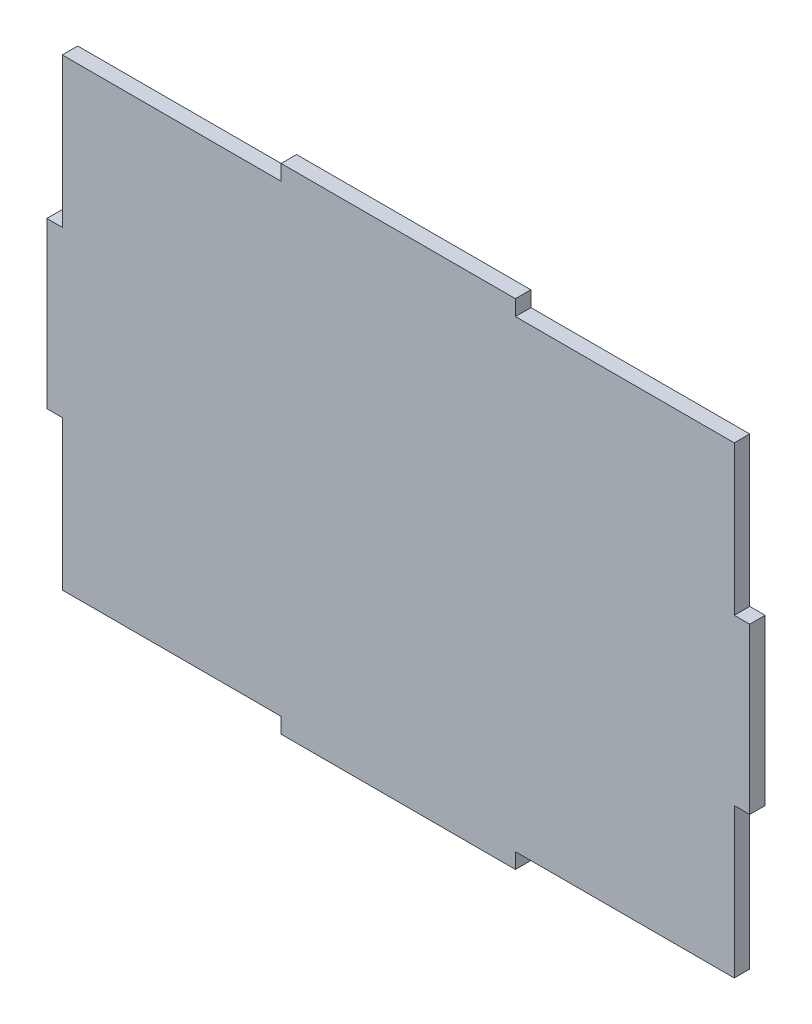
ISO-10303-21;
HEADER;
FILE_DESCRIPTION(('STEP AP214'),'2;1');
FILE_NAME('part.step','',(''),(''),'','','');
FILE_SCHEMA(('AUTOMOTIVE_DESIGN { 1 0 10303 214 1 1 1 1 }'));
ENDSEC;
DATA;
#1=APPLICATION_CONTEXT('core data for automotive mechanical design processes');
#2=APPLICATION_PROTOCOL_DEFINITION('international standard','automotive_design',2000,#1);
#3=PRODUCT_CONTEXT('',#1,'mechanical');
#4=PRODUCT('Part','Part','',(#3));
#5=PRODUCT_RELATED_PRODUCT_CATEGORY('part','',(#4));
#6=PRODUCT_DEFINITION_FORMATION('','',#4);
#7=PRODUCT_DEFINITION_CONTEXT('part definition',#1,'design');
#8=PRODUCT_DEFINITION('design','',#6,#7);
#9=PRODUCT_DEFINITION_SHAPE('','',#8);
#10=(LENGTH_UNIT() NAMED_UNIT(*) SI_UNIT(.MILLI.,.METRE.));
#11=(NAMED_UNIT(*) PLANE_ANGLE_UNIT() SI_UNIT($,.RADIAN.));
#12=(NAMED_UNIT(*) SI_UNIT($,.STERADIAN.) SOLID_ANGLE_UNIT());
#13=UNCERTAINTY_MEASURE_WITH_UNIT(LENGTH_MEASURE(1.E-05),#10,'distance_accuracy_value','');
#14=(GEOMETRIC_REPRESENTATION_CONTEXT(3) GLOBAL_UNCERTAINTY_ASSIGNED_CONTEXT((#13)) GLOBAL_UNIT_ASSIGNED_CONTEXT((#10,
#11,#12)) REPRESENTATION_CONTEXT('',''));
#15=CARTESIAN_POINT('',(0.,0.,0.));
#16=DIRECTION('',(0.,0.,1.));
#17=DIRECTION('',(1.,0.,0.));
#18=AXIS2_PLACEMENT_3D('',#15,#16,#17);
#19=CARTESIAN_POINT('',(115.57,-81.28,5.08));
#20=DIRECTION('',(-1.,0.,0.));
#21=DIRECTION('',(0.,0.,1.));
#22=AXIS2_PLACEMENT_3D('',#19,#20,#21);
#23=PLANE('',#22);
#24=DIRECTION('',(0.,0.,-1.));
#25=VECTOR('',#24,1.);
#26=CARTESIAN_POINT('',(115.57,-27.0933333333333,0.));
#27=LINE('',#26,#25);
#28=CARTESIAN_POINT('',(115.57,-27.0933333333333,5.07999999999998));
#29=VERTEX_POINT('',#28);
#30=CARTESIAN_POINT('',(115.57,-27.0933333333333,0.));
#31=VERTEX_POINT('',#30);
#32=EDGE_CURVE('E299',#29,#31,#27,.T.);
#33=ORIENTED_EDGE('',*,*,#32,.T.);
#34=DIRECTION('',(0.,1.,0.));
#35=VECTOR('',#34,1.);
#36=CARTESIAN_POINT('',(115.57,-81.28,0.));
#37=LINE('',#36,#35);
#38=CARTESIAN_POINT('',(115.57,27.0933333333333,0.));
#39=VERTEX_POINT('',#38);
#40=EDGE_CURVE('E199',#31,#39,#37,.T.);
#41=ORIENTED_EDGE('',*,*,#40,.T.);
#42=DIRECTION('',(0.,0.,1.));
#43=VECTOR('',#42,1.);
#44=CARTESIAN_POINT('',(115.57,27.0933333333333,0.));
#45=LINE('',#44,#43);
#46=CARTESIAN_POINT('',(115.57,27.0933333333333,5.07999999999998));
#47=VERTEX_POINT('',#46);
#48=EDGE_CURVE('E303',#39,#47,#45,.T.);
#49=ORIENTED_EDGE('',*,*,#48,.T.);
#50=DIRECTION('',(0.,1.,0.));
#51=VECTOR('',#50,1.);
#52=CARTESIAN_POINT('',(115.57,-81.28,5.08));
#53=LINE('',#52,#51);
#54=EDGE_CURVE('E209',#29,#47,#53,.T.);
#55=ORIENTED_EDGE('',*,*,#54,.F.);
#56=EDGE_LOOP('',(#33,#41,#49,#55));
#57=FACE_BOUND('',#56,.T.);
#58=ADVANCED_FACE('F33',(#57),#23,.F.);
#59=CARTESIAN_POINT('',(-115.57,81.28,5.08));
#60=DIRECTION('',(0.,-1.,0.));
#61=DIRECTION('',(0.,0.,-1.));
#62=AXIS2_PLACEMENT_3D('',#59,#60,#61);
#63=PLANE('',#62);
#64=DIRECTION('',(0.,0.,-1.));
#65=VECTOR('',#64,1.);
#66=CARTESIAN_POINT('',(-38.5233333333334,81.28,0.));
#67=LINE('',#66,#65);
#68=CARTESIAN_POINT('',(-38.5233333333334,81.28,5.07999999999997));
#69=VERTEX_POINT('',#68);
#70=CARTESIAN_POINT('',(-38.5233333333334,81.28,0.));
#71=VERTEX_POINT('',#70);
#72=EDGE_CURVE('E180',#69,#71,#67,.T.);
#73=ORIENTED_EDGE('',*,*,#72,.F.);
#74=DIRECTION('',(-1.,0.,0.));
#75=VECTOR('',#74,1.);
#76=CARTESIAN_POINT('',(-115.57,81.28,5.08));
#77=LINE('',#76,#75);
#78=CARTESIAN_POINT('',(38.5233333333333,81.28,5.07999999999997));
#79=VERTEX_POINT('',#78);
#80=EDGE_CURVE('E189',#79,#69,#77,.T.);
#81=ORIENTED_EDGE('',*,*,#80,.F.);
#82=DIRECTION('',(0.,0.,1.));
#83=VECTOR('',#82,1.);
#84=CARTESIAN_POINT('',(38.5233333333333,81.28,0.));
#85=LINE('',#84,#83);
#86=CARTESIAN_POINT('',(38.5233333333333,81.28,0.));
#87=VERTEX_POINT('',#86);
#88=EDGE_CURVE('E174',#87,#79,#85,.T.);
#89=ORIENTED_EDGE('',*,*,#88,.F.);
#90=DIRECTION('',(-1.,0.,0.));
#91=VECTOR('',#90,1.);
#92=CARTESIAN_POINT('',(-115.57,81.28,0.));
#93=LINE('',#92,#91);
#94=EDGE_CURVE('E187',#87,#71,#93,.T.);
#95=ORIENTED_EDGE('',*,*,#94,.T.);
#96=EDGE_LOOP('',(#73,#81,#89,#95));
#97=FACE_BOUND('',#96,.T.);
#98=ADVANCED_FACE('F186',(#97),#63,.F.);
#99=CARTESIAN_POINT('',(-115.57,-81.28,5.08));
#100=DIRECTION('',(1.,0.,0.));
#101=DIRECTION('',(0.,0.,-1.));
#102=AXIS2_PLACEMENT_3D('',#99,#100,#101);
#103=PLANE('',#102);
#104=DIRECTION('',(0.,0.,-1.));
#105=VECTOR('',#104,1.);
#106=CARTESIAN_POINT('',(-115.57,27.0933333333333,0.));
#107=LINE('',#106,#105);
#108=CARTESIAN_POINT('',(-115.57,27.0933333333333,5.07999999999998));
#109=VERTEX_POINT('',#108);
#110=CARTESIAN_POINT('',(-115.57,27.0933333333333,0.));
#111=VERTEX_POINT('',#110);
#112=EDGE_CURVE('E273',#109,#111,#107,.T.);
#113=ORIENTED_EDGE('',*,*,#112,.T.);
#114=DIRECTION('',(0.,-1.,0.));
#115=VECTOR('',#114,1.);
#116=CARTESIAN_POINT('',(-115.57,-81.28,0.));
#117=LINE('',#116,#115);
#118=CARTESIAN_POINT('',(-115.57,-27.0933333333334,0.));
#119=VERTEX_POINT('',#118);
#120=EDGE_CURVE('E198',#111,#119,#117,.T.);
#121=ORIENTED_EDGE('',*,*,#120,.T.);
#122=DIRECTION('',(0.,0.,1.));
#123=VECTOR('',#122,1.);
#124=CARTESIAN_POINT('',(-115.57,-27.0933333333334,0.));
#125=LINE('',#124,#123);
#126=CARTESIAN_POINT('',(-115.57,-27.0933333333334,5.07999999999998));
#127=VERTEX_POINT('',#126);
#128=EDGE_CURVE('E277',#119,#127,#125,.T.);
#129=ORIENTED_EDGE('',*,*,#128,.T.);
#130=DIRECTION('',(0.,-1.,0.));
#131=VECTOR('',#130,1.);
#132=CARTESIAN_POINT('',(-115.57,-81.28,5.08));
#133=LINE('',#132,#131);
#134=EDGE_CURVE('E41',#109,#127,#133,.T.);
#135=ORIENTED_EDGE('',*,*,#134,.F.);
#136=EDGE_LOOP('',(#113,#121,#129,#135));
#137=FACE_BOUND('',#136,.T.);
#138=ADVANCED_FACE('F374',(#137),#103,.F.);
#139=CARTESIAN_POINT('',(-115.57,-81.28,5.08));
#140=DIRECTION('',(0.,1.,0.));
#141=DIRECTION('',(0.,0.,1.));
#142=AXIS2_PLACEMENT_3D('',#139,#140,#141);
#143=PLANE('',#142);
#144=DIRECTION('',(0.,0.,-1.));
#145=VECTOR('',#144,1.);
#146=CARTESIAN_POINT('',(-38.5233333333334,-81.28,0.));
#147=LINE('',#146,#145);
#148=CARTESIAN_POINT('',(-38.5233333333334,-81.28,5.07999999999997));
#149=VERTEX_POINT('',#148);
#150=CARTESIAN_POINT('',(-38.5233333333334,-81.28,0.));
#151=VERTEX_POINT('',#150);
#152=EDGE_CURVE('E240',#149,#151,#147,.T.);
#153=ORIENTED_EDGE('',*,*,#152,.T.);
#154=DIRECTION('',(1.,0.,0.));
#155=VECTOR('',#154,1.);
#156=CARTESIAN_POINT('',(-115.57,-81.28,0.));
#157=LINE('',#156,#155);
#158=CARTESIAN_POINT('',(38.5233333333333,-81.28,0.));
#159=VERTEX_POINT('',#158);
#160=EDGE_CURVE('E36',#151,#159,#157,.T.);
#161=ORIENTED_EDGE('',*,*,#160,.T.);
#162=DIRECTION('',(0.,0.,1.));
#163=VECTOR('',#162,1.);
#164=CARTESIAN_POINT('',(38.5233333333333,-81.28,0.));
#165=LINE('',#164,#163);
#166=CARTESIAN_POINT('',(38.5233333333333,-81.28,5.07999999999997));
#167=VERTEX_POINT('',#166);
#168=EDGE_CURVE('E244',#159,#167,#165,.T.);
#169=ORIENTED_EDGE('',*,*,#168,.T.);
#170=DIRECTION('',(1.,0.,0.));
#171=VECTOR('',#170,1.);
#172=CARTESIAN_POINT('',(-115.57,-81.28,5.08));
#173=LINE('',#172,#171);
#174=EDGE_CURVE('E11',#149,#167,#173,.T.);
#175=ORIENTED_EDGE('',*,*,#174,.F.);
#176=EDGE_LOOP('',(#153,#161,#169,#175));
#177=FACE_BOUND('',#176,.T.);
#178=ADVANCED_FACE('F355',(#177),#143,.F.);
#179=CARTESIAN_POINT('',(0.,0.,5.08));
#180=DIRECTION('',(0.,0.,-1.));
#181=DIRECTION('',(-1.,0.,0.));
#182=AXIS2_PLACEMENT_3D('',#179,#180,#181);
#183=PLANE('',#182);
#184=DIRECTION('',(0.,-1.,0.));
#185=VECTOR('',#184,1.);
#186=CARTESIAN_POINT('',(-38.5233333333334,81.28,5.07999999999997));
#187=LINE('',#186,#185);
#188=CARTESIAN_POINT('',(-38.5233333333334,76.2,5.07999999999997));
#189=VERTEX_POINT('',#188);
#190=EDGE_CURVE('E312',#69,#189,#187,.T.);
#191=ORIENTED_EDGE('',*,*,#190,.T.);
#192=DIRECTION('',(1.,0.,0.));
#193=VECTOR('',#192,1.);
#194=CARTESIAN_POINT('',(0.,76.2,5.08));
#195=LINE('',#194,#193);
#196=CARTESIAN_POINT('',(-110.49,76.2,5.08));
#197=VERTEX_POINT('',#196);
#198=EDGE_CURVE('E223',#197,#189,#195,.T.);
#199=ORIENTED_EDGE('',*,*,#198,.F.);
#200=DIRECTION('',(0.,-1.,0.));
#201=VECTOR('',#200,1.);
#202=CARTESIAN_POINT('',(-110.49,0.,5.08));
#203=LINE('',#202,#201);
#204=CARTESIAN_POINT('',(-110.49,27.0933333333333,5.07999999999998));
#205=VERTEX_POINT('',#204);
#206=EDGE_CURVE('E215',#197,#205,#203,.T.);
#207=ORIENTED_EDGE('',*,*,#206,.T.);
#208=DIRECTION('',(-1.,0.,0.));
#209=VECTOR('',#208,1.);
#210=CARTESIAN_POINT('',(-110.49,27.0933333333333,5.07999999999998));
#211=LINE('',#210,#209);
#212=EDGE_CURVE('E268',#205,#109,#211,.T.);
#213=ORIENTED_EDGE('',*,*,#212,.T.);
#214=ORIENTED_EDGE('',*,*,#134,.T.);
#215=DIRECTION('',(-1.,0.,0.));
#216=VECTOR('',#215,1.);
#217=CARTESIAN_POINT('',(-110.49,-27.0933333333334,5.07999999999998));
#218=LINE('',#217,#216);
#219=CARTESIAN_POINT('',(-110.49,-27.0933333333334,5.07999999999998));
#220=VERTEX_POINT('',#219);
#221=EDGE_CURVE('E265',#220,#127,#218,.T.);
#222=ORIENTED_EDGE('',*,*,#221,.F.);
#223=CARTESIAN_POINT('',(-110.49,-76.2,5.08000000000002));
#224=VERTEX_POINT('',#223);
#225=EDGE_CURVE('E216',#220,#224,#203,.T.);
#226=ORIENTED_EDGE('',*,*,#225,.T.);
#227=DIRECTION('',(1.,0.,0.));
#228=VECTOR('',#227,1.);
#229=CARTESIAN_POINT('',(0.,-76.2,5.08));
#230=LINE('',#229,#228);
#231=CARTESIAN_POINT('',(-38.5233333333334,-76.2,5.07999999999997));
#232=VERTEX_POINT('',#231);
#233=EDGE_CURVE('E203',#224,#232,#230,.T.);
#234=ORIENTED_EDGE('',*,*,#233,.T.);
#235=DIRECTION('',(0.,-1.,0.));
#236=VECTOR('',#235,1.);
#237=CARTESIAN_POINT('',(-38.5233333333334,-76.2,5.07999999999997));
#238=LINE('',#237,#236);
#239=EDGE_CURVE('E235',#232,#149,#238,.T.);
#240=ORIENTED_EDGE('',*,*,#239,.T.);
#241=ORIENTED_EDGE('',*,*,#174,.T.);
#242=DIRECTION('',(0.,-1.,0.));
#243=VECTOR('',#242,1.);
#244=CARTESIAN_POINT('',(38.5233333333333,-76.2,5.07999999999997));
#245=LINE('',#244,#243);
#246=CARTESIAN_POINT('',(38.5233333333333,-76.2,5.07999999999997));
#247=VERTEX_POINT('',#246);
#248=EDGE_CURVE('E232',#247,#167,#245,.T.);
#249=ORIENTED_EDGE('',*,*,#248,.F.);
#250=CARTESIAN_POINT('',(110.49,-76.2,5.08000000000002));
#251=VERTEX_POINT('',#250);
#252=EDGE_CURVE('E212',#247,#251,#230,.T.);
#253=ORIENTED_EDGE('',*,*,#252,.T.);
#254=DIRECTION('',(0.,1.,0.));
#255=VECTOR('',#254,1.);
#256=CARTESIAN_POINT('',(110.49,0.,5.08));
#257=LINE('',#256,#255);
#258=CARTESIAN_POINT('',(110.49,-27.0933333333333,5.07999999999998));
#259=VERTEX_POINT('',#258);
#260=EDGE_CURVE('E219',#251,#259,#257,.T.);
#261=ORIENTED_EDGE('',*,*,#260,.T.);
#262=DIRECTION('',(1.,0.,0.));
#263=VECTOR('',#262,1.);
#264=CARTESIAN_POINT('',(110.49,-27.0933333333333,5.07999999999998));
#265=LINE('',#264,#263);
#266=EDGE_CURVE('E294',#259,#29,#265,.T.);
#267=ORIENTED_EDGE('',*,*,#266,.T.);
#268=ORIENTED_EDGE('',*,*,#54,.T.);
#269=DIRECTION('',(1.,0.,0.));
#270=VECTOR('',#269,1.);
#271=CARTESIAN_POINT('',(110.49,27.0933333333333,5.07999999999998));
#272=LINE('',#271,#270);
#273=CARTESIAN_POINT('',(110.49,27.0933333333333,5.07999999999998));
#274=VERTEX_POINT('',#273);
#275=EDGE_CURVE('E292',#274,#47,#272,.T.);
#276=ORIENTED_EDGE('',*,*,#275,.F.);
#277=CARTESIAN_POINT('',(110.49,76.2,5.08));
#278=VERTEX_POINT('',#277);
#279=EDGE_CURVE('E220',#274,#278,#257,.T.);
#280=ORIENTED_EDGE('',*,*,#279,.T.);
#281=CARTESIAN_POINT('',(38.5233333333333,76.2,5.07999999999997));
#282=VERTEX_POINT('',#281);
#283=EDGE_CURVE('E224',#282,#278,#195,.T.);
#284=ORIENTED_EDGE('',*,*,#283,.F.);
#285=DIRECTION('',(0.,-1.,0.));
#286=VECTOR('',#285,1.);
#287=CARTESIAN_POINT('',(38.5233333333333,81.28,5.07999999999997));
#288=LINE('',#287,#286);
#289=EDGE_CURVE('E179',#79,#282,#288,.T.);
#290=ORIENTED_EDGE('',*,*,#289,.F.);
#291=ORIENTED_EDGE('',*,*,#80,.T.);
#292=EDGE_LOOP('',(#191,#199,#207,#213,#214,#222,#226,#234,#240,#241,#249,#253,#261,#267,#268,
#276,#280,#284,#290,#291));
#293=FACE_BOUND('',#292,.T.);
#294=ADVANCED_FACE('F322',(#293),#183,.F.);
#295=CARTESIAN_POINT('',(0.,0.,0.));
#296=DIRECTION('',(0.,0.,-1.));
#297=DIRECTION('',(-1.,0.,0.));
#298=AXIS2_PLACEMENT_3D('',#295,#296,#297);
#299=PLANE('',#298);
#300=ORIENTED_EDGE('',*,*,#160,.F.);
#301=DIRECTION('',(0.,-1.,0.));
#302=VECTOR('',#301,1.);
#303=CARTESIAN_POINT('',(-38.5233333333334,-76.2,0.));
#304=LINE('',#303,#302);
#305=CARTESIAN_POINT('',(-38.5233333333334,-76.2,0.));
#306=VERTEX_POINT('',#305);
#307=EDGE_CURVE('E238',#306,#151,#304,.T.);
#308=ORIENTED_EDGE('',*,*,#307,.F.);
#309=DIRECTION('',(1.,0.,0.));
#310=VECTOR('',#309,1.);
#311=CARTESIAN_POINT('',(-115.57,-76.2,0.));
#312=LINE('',#311,#310);
#313=CARTESIAN_POINT('',(-110.49,-76.2,0.));
#314=VERTEX_POINT('',#313);
#315=EDGE_CURVE('E226',#314,#306,#312,.T.);
#316=ORIENTED_EDGE('',*,*,#315,.F.);
#317=DIRECTION('',(0.,-1.,0.));
#318=VECTOR('',#317,1.);
#319=CARTESIAN_POINT('',(-110.49,81.28,0.));
#320=LINE('',#319,#318);
#321=CARTESIAN_POINT('',(-110.49,-27.0933333333334,0.));
#322=VERTEX_POINT('',#321);
#323=EDGE_CURVE('E261',#322,#314,#320,.T.);
#324=ORIENTED_EDGE('',*,*,#323,.F.);
#325=DIRECTION('',(-1.,0.,0.));
#326=VECTOR('',#325,1.);
#327=CARTESIAN_POINT('',(-110.49,-27.0933333333334,0.));
#328=LINE('',#327,#326);
#329=EDGE_CURVE('E262',#322,#119,#328,.T.);
#330=ORIENTED_EDGE('',*,*,#329,.T.);
#331=ORIENTED_EDGE('',*,*,#120,.F.);
#332=DIRECTION('',(-1.,0.,0.));
#333=VECTOR('',#332,1.);
#334=CARTESIAN_POINT('',(-110.49,27.0933333333333,0.));
#335=LINE('',#334,#333);
#336=CARTESIAN_POINT('',(-110.49,27.0933333333333,0.));
#337=VERTEX_POINT('',#336);
#338=EDGE_CURVE('E271',#337,#111,#335,.T.);
#339=ORIENTED_EDGE('',*,*,#338,.F.);
#340=CARTESIAN_POINT('',(-110.49,76.2,0.));
#341=VERTEX_POINT('',#340);
#342=EDGE_CURVE('E259',#341,#337,#320,.T.);
#343=ORIENTED_EDGE('',*,*,#342,.F.);
#344=DIRECTION('',(1.,0.,0.));
#345=VECTOR('',#344,1.);
#346=CARTESIAN_POINT('',(-115.57,76.2,0.));
#347=LINE('',#346,#345);
#348=CARTESIAN_POINT('',(-38.5233333333334,76.2,0.));
#349=VERTEX_POINT('',#348);
#350=EDGE_CURVE('E306',#341,#349,#347,.T.);
#351=ORIENTED_EDGE('',*,*,#350,.T.);
#352=DIRECTION('',(0.,-1.,0.));
#353=VECTOR('',#352,1.);
#354=CARTESIAN_POINT('',(-38.5233333333334,81.28,0.));
#355=LINE('',#354,#353);
#356=EDGE_CURVE('E197',#71,#349,#355,.T.);
#357=ORIENTED_EDGE('',*,*,#356,.F.);
#358=ORIENTED_EDGE('',*,*,#94,.F.);
#359=DIRECTION('',(0.,-1.,0.));
#360=VECTOR('',#359,1.);
#361=CARTESIAN_POINT('',(38.5233333333333,81.28,0.));
#362=LINE('',#361,#360);
#363=CARTESIAN_POINT('',(38.5233333333333,76.2,0.));
#364=VERTEX_POINT('',#363);
#365=EDGE_CURVE('E171',#87,#364,#362,.T.);
#366=ORIENTED_EDGE('',*,*,#365,.T.);
#367=CARTESIAN_POINT('',(110.49,76.2,0.));
#368=VERTEX_POINT('',#367);
#369=EDGE_CURVE('E57',#364,#368,#347,.T.);
#370=ORIENTED_EDGE('',*,*,#369,.T.);
#371=DIRECTION('',(0.,1.,0.));
#372=VECTOR('',#371,1.);
#373=CARTESIAN_POINT('',(110.49,-81.28,0.));
#374=LINE('',#373,#372);
#375=CARTESIAN_POINT('',(110.49,27.0933333333333,0.));
#376=VERTEX_POINT('',#375);
#377=EDGE_CURVE('E288',#376,#368,#374,.T.);
#378=ORIENTED_EDGE('',*,*,#377,.F.);
#379=DIRECTION('',(1.,0.,0.));
#380=VECTOR('',#379,1.);
#381=CARTESIAN_POINT('',(110.49,27.0933333333333,0.));
#382=LINE('',#381,#380);
#383=EDGE_CURVE('E289',#376,#39,#382,.T.);
#384=ORIENTED_EDGE('',*,*,#383,.T.);
#385=ORIENTED_EDGE('',*,*,#40,.F.);
#386=DIRECTION('',(1.,0.,0.));
#387=VECTOR('',#386,1.);
#388=CARTESIAN_POINT('',(110.49,-27.0933333333333,0.));
#389=LINE('',#388,#387);
#390=CARTESIAN_POINT('',(110.49,-27.0933333333333,0.));
#391=VERTEX_POINT('',#390);
#392=EDGE_CURVE('E297',#391,#31,#389,.T.);
#393=ORIENTED_EDGE('',*,*,#392,.F.);
#394=CARTESIAN_POINT('',(110.49,-76.2,0.));
#395=VERTEX_POINT('',#394);
#396=EDGE_CURVE('E286',#395,#391,#374,.T.);
#397=ORIENTED_EDGE('',*,*,#396,.F.);
#398=CARTESIAN_POINT('',(38.5233333333333,-76.2,0.));
#399=VERTEX_POINT('',#398);
#400=EDGE_CURVE('E228',#399,#395,#312,.T.);
#401=ORIENTED_EDGE('',*,*,#400,.F.);
#402=DIRECTION('',(0.,-1.,0.));
#403=VECTOR('',#402,1.);
#404=CARTESIAN_POINT('',(38.5233333333333,-76.2,0.));
#405=LINE('',#404,#403);
#406=EDGE_CURVE('E229',#399,#159,#405,.T.);
#407=ORIENTED_EDGE('',*,*,#406,.T.);
#408=EDGE_LOOP('',(#300,#308,#316,#324,#330,#331,#339,#343,#351,#357,#358,#366,#370,#378,#384,
#385,#393,#397,#401,#407));
#409=FACE_BOUND('',#408,.T.);
#410=ADVANCED_FACE('F194',(#409),#299,.T.);
#411=CARTESIAN_POINT('',(38.5233333333333,81.28,0.));
#412=DIRECTION('',(1.,0.,0.));
#413=DIRECTION('',(0.,1.,0.));
#414=AXIS2_PLACEMENT_3D('',#411,#412,#413);
#415=PLANE('',#414);
#416=DIRECTION('',(0.,0.,1.));
#417=VECTOR('',#416,1.);
#418=CARTESIAN_POINT('',(38.5233333333333,76.2,0.));
#419=LINE('',#418,#417);
#420=EDGE_CURVE('E176',#364,#282,#419,.T.);
#421=ORIENTED_EDGE('',*,*,#420,.F.);
#422=ORIENTED_EDGE('',*,*,#365,.F.);
#423=ORIENTED_EDGE('',*,*,#88,.T.);
#424=ORIENTED_EDGE('',*,*,#289,.T.);
#425=EDGE_LOOP('',(#421,#422,#423,#424));
#426=FACE_BOUND('',#425,.T.);
#427=ADVANCED_FACE('F173',(#426),#415,.T.);
#428=CARTESIAN_POINT('',(0.,76.2,36.83));
#429=DIRECTION('',(0.,1.,0.));
#430=DIRECTION('',(-1.,0.,0.));
#431=AXIS2_PLACEMENT_3D('',#428,#429,#430);
#432=PLANE('',#431);
#433=ORIENTED_EDGE('',*,*,#283,.T.);
#434=DIRECTION('',(0.,0.,-1.));
#435=VECTOR('',#434,1.);
#436=CARTESIAN_POINT('',(110.49,76.2,36.83));
#437=LINE('',#436,#435);
#438=EDGE_CURVE('E280',#278,#368,#437,.T.);
#439=ORIENTED_EDGE('',*,*,#438,.T.);
#440=ORIENTED_EDGE('',*,*,#369,.F.);
#441=ORIENTED_EDGE('',*,*,#420,.T.);
#442=EDGE_LOOP('',(#433,#439,#440,#441));
#443=FACE_BOUND('',#442,.T.);
#444=ADVANCED_FACE('F325',(#443),#432,.T.);
#445=CARTESIAN_POINT('',(110.49,27.0933333333333,0.));
#446=DIRECTION('',(0.,1.,0.));
#447=DIRECTION('',(-1.,0.,0.));
#448=AXIS2_PLACEMENT_3D('',#445,#446,#447);
#449=PLANE('',#448);
#450=ORIENTED_EDGE('',*,*,#48,.F.);
#451=ORIENTED_EDGE('',*,*,#383,.F.);
#452=DIRECTION('',(0.,0.,1.));
#453=VECTOR('',#452,1.);
#454=CARTESIAN_POINT('',(110.49,27.0933333333333,0.));
#455=LINE('',#454,#453);
#456=EDGE_CURVE('E302',#376,#274,#455,.T.);
#457=ORIENTED_EDGE('',*,*,#456,.T.);
#458=ORIENTED_EDGE('',*,*,#275,.T.);
#459=EDGE_LOOP('',(#450,#451,#457,#458));
#460=FACE_BOUND('',#459,.T.);
#461=ADVANCED_FACE('F334',(#460),#449,.T.);
#462=CARTESIAN_POINT('',(110.49,0.,36.83));
#463=DIRECTION('',(-1.,0.,0.));
#464=DIRECTION('',(0.,-1.,0.));
#465=AXIS2_PLACEMENT_3D('',#462,#463,#464);
#466=PLANE('',#465);
#467=ORIENTED_EDGE('',*,*,#456,.F.);
#468=ORIENTED_EDGE('',*,*,#377,.T.);
#469=ORIENTED_EDGE('',*,*,#438,.F.);
#470=ORIENTED_EDGE('',*,*,#279,.F.);
#471=EDGE_LOOP('',(#467,#468,#469,#470));
#472=FACE_BOUND('',#471,.T.);
#473=ADVANCED_FACE('F329',(#472),#466,.F.);
#474=CARTESIAN_POINT('',(-110.49,27.0933333333333,0.));
#475=DIRECTION('',(0.,1.,0.));
#476=DIRECTION('',(-1.,0.,0.));
#477=AXIS2_PLACEMENT_3D('',#474,#475,#476);
#478=PLANE('',#477);
#479=ORIENTED_EDGE('',*,*,#112,.F.);
#480=ORIENTED_EDGE('',*,*,#212,.F.);
#481=DIRECTION('',(0.,0.,-1.));
#482=VECTOR('',#481,1.);
#483=CARTESIAN_POINT('',(-110.49,27.0933333333333,0.));
#484=LINE('',#483,#482);
#485=EDGE_CURVE('E266',#205,#337,#484,.T.);
#486=ORIENTED_EDGE('',*,*,#485,.T.);
#487=ORIENTED_EDGE('',*,*,#338,.T.);
#488=EDGE_LOOP('',(#479,#480,#486,#487));
#489=FACE_BOUND('',#488,.T.);
#490=ADVANCED_FACE('F377',(#489),#478,.T.);
#491=CARTESIAN_POINT('',(-38.5233333333334,81.28,0.));
#492=DIRECTION('',(-1.,0.,0.));
#493=DIRECTION('',(0.,-1.,0.));
#494=AXIS2_PLACEMENT_3D('',#491,#492,#493);
#495=PLANE('',#494);
#496=DIRECTION('',(0.,0.,-1.));
#497=VECTOR('',#496,1.);
#498=CARTESIAN_POINT('',(-38.5233333333334,76.2,0.));
#499=LINE('',#498,#497);
#500=EDGE_CURVE('E190',#189,#349,#499,.T.);
#501=ORIENTED_EDGE('',*,*,#500,.F.);
#502=ORIENTED_EDGE('',*,*,#190,.F.);
#503=ORIENTED_EDGE('',*,*,#72,.T.);
#504=ORIENTED_EDGE('',*,*,#356,.T.);
#505=EDGE_LOOP('',(#501,#502,#503,#504));
#506=FACE_BOUND('',#505,.T.);
#507=ADVANCED_FACE('F320',(#506),#495,.T.);
#508=ORIENTED_EDGE('',*,*,#198,.T.);
#509=ORIENTED_EDGE('',*,*,#500,.T.);
#510=ORIENTED_EDGE('',*,*,#350,.F.);
#511=DIRECTION('',(0.,0.,1.));
#512=VECTOR('',#511,1.);
#513=CARTESIAN_POINT('',(-110.49,76.2,36.83));
#514=LINE('',#513,#512);
#515=EDGE_CURVE('E256',#341,#197,#514,.T.);
#516=ORIENTED_EDGE('',*,*,#515,.T.);
#517=EDGE_LOOP('',(#508,#509,#510,#516));
#518=FACE_BOUND('',#517,.T.);
#519=ADVANCED_FACE('F384',(#518),#432,.T.);
#520=CARTESIAN_POINT('',(-110.49,0.,36.83));
#521=DIRECTION('',(1.,0.,0.));
#522=DIRECTION('',(0.,1.,0.));
#523=AXIS2_PLACEMENT_3D('',#520,#521,#522);
#524=PLANE('',#523);
#525=ORIENTED_EDGE('',*,*,#515,.F.);
#526=ORIENTED_EDGE('',*,*,#342,.T.);
#527=ORIENTED_EDGE('',*,*,#485,.F.);
#528=ORIENTED_EDGE('',*,*,#206,.F.);
#529=EDGE_LOOP('',(#525,#526,#527,#528));
#530=FACE_BOUND('',#529,.T.);
#531=ADVANCED_FACE('F381',(#530),#524,.F.);
#532=CARTESIAN_POINT('',(110.49,-27.0933333333333,0.));
#533=DIRECTION('',(0.,-1.,0.));
#534=DIRECTION('',(1.,0.,0.));
#535=AXIS2_PLACEMENT_3D('',#532,#533,#534);
#536=PLANE('',#535);
#537=ORIENTED_EDGE('',*,*,#32,.F.);
#538=ORIENTED_EDGE('',*,*,#266,.F.);
#539=DIRECTION('',(0.,0.,-1.));
#540=VECTOR('',#539,1.);
#541=CARTESIAN_POINT('',(110.49,-27.0933333333333,0.));
#542=LINE('',#541,#540);
#543=EDGE_CURVE('E49',#259,#391,#542,.T.);
#544=ORIENTED_EDGE('',*,*,#543,.T.);
#545=ORIENTED_EDGE('',*,*,#392,.T.);
#546=EDGE_LOOP('',(#537,#538,#544,#545));
#547=FACE_BOUND('',#546,.T.);
#548=ADVANCED_FACE('F341',(#547),#536,.T.);
#549=DIRECTION('',(0.,0.,-1.));
#550=VECTOR('',#549,1.);
#551=CARTESIAN_POINT('',(110.49,-76.2,49.1066666666666));
#552=LINE('',#551,#550);
#553=EDGE_CURVE('E254',#251,#395,#552,.T.);
#554=ORIENTED_EDGE('',*,*,#553,.T.);
#555=ORIENTED_EDGE('',*,*,#396,.T.);
#556=ORIENTED_EDGE('',*,*,#543,.F.);
#557=ORIENTED_EDGE('',*,*,#260,.F.);
#558=EDGE_LOOP('',(#554,#555,#556,#557));
#559=FACE_BOUND('',#558,.T.);
#560=ADVANCED_FACE('F346',(#559),#466,.F.);
#561=CARTESIAN_POINT('',(38.5233333333333,-76.2,0.));
#562=DIRECTION('',(1.,0.,0.));
#563=DIRECTION('',(0.,1.,0.));
#564=AXIS2_PLACEMENT_3D('',#561,#562,#563);
#565=PLANE('',#564);
#566=ORIENTED_EDGE('',*,*,#168,.F.);
#567=ORIENTED_EDGE('',*,*,#406,.F.);
#568=DIRECTION('',(0.,0.,1.));
#569=VECTOR('',#568,1.);
#570=CARTESIAN_POINT('',(38.5233333333333,-76.2,0.));
#571=LINE('',#570,#569);
#572=EDGE_CURVE('E243',#399,#247,#571,.T.);
#573=ORIENTED_EDGE('',*,*,#572,.T.);
#574=ORIENTED_EDGE('',*,*,#248,.T.);
#575=EDGE_LOOP('',(#566,#567,#573,#574));
#576=FACE_BOUND('',#575,.T.);
#577=ADVANCED_FACE('F414',(#576),#565,.T.);
#578=CARTESIAN_POINT('',(0.,-76.2,36.83));
#579=DIRECTION('',(0.,1.,0.));
#580=DIRECTION('',(-1.,0.,0.));
#581=AXIS2_PLACEMENT_3D('',#578,#579,#580);
#582=PLANE('',#581);
#583=ORIENTED_EDGE('',*,*,#572,.F.);
#584=ORIENTED_EDGE('',*,*,#400,.T.);
#585=ORIENTED_EDGE('',*,*,#553,.F.);
#586=ORIENTED_EDGE('',*,*,#252,.F.);
#587=EDGE_LOOP('',(#583,#584,#585,#586));
#588=FACE_BOUND('',#587,.T.);
#589=ADVANCED_FACE('F349',(#588),#582,.F.);
#590=DIRECTION('',(0.,0.,1.));
#591=VECTOR('',#590,1.);
#592=CARTESIAN_POINT('',(-110.49,-76.2,49.1066666666666));
#593=LINE('',#592,#591);
#594=EDGE_CURVE('E247',#314,#224,#593,.T.);
#595=ORIENTED_EDGE('',*,*,#594,.F.);
#596=ORIENTED_EDGE('',*,*,#315,.T.);
#597=DIRECTION('',(0.,0.,-1.));
#598=VECTOR('',#597,1.);
#599=CARTESIAN_POINT('',(-38.5233333333334,-76.2,0.));
#600=LINE('',#599,#598);
#601=EDGE_CURVE('E233',#232,#306,#600,.T.);
#602=ORIENTED_EDGE('',*,*,#601,.F.);
#603=ORIENTED_EDGE('',*,*,#233,.F.);
#604=EDGE_LOOP('',(#595,#596,#602,#603));
#605=FACE_BOUND('',#604,.T.);
#606=ADVANCED_FACE('F363',(#605),#582,.F.);
#607=DIRECTION('',(0.,0.,1.));
#608=VECTOR('',#607,1.);
#609=CARTESIAN_POINT('',(-110.49,-27.0933333333334,0.));
#610=LINE('',#609,#608);
#611=EDGE_CURVE('E276',#322,#220,#610,.T.);
#612=ORIENTED_EDGE('',*,*,#611,.F.);
#613=ORIENTED_EDGE('',*,*,#323,.T.);
#614=ORIENTED_EDGE('',*,*,#594,.T.);
#615=ORIENTED_EDGE('',*,*,#225,.F.);
#616=EDGE_LOOP('',(#612,#613,#614,#615));
#617=FACE_BOUND('',#616,.T.);
#618=ADVANCED_FACE('F366',(#617),#524,.F.);
#619=CARTESIAN_POINT('',(-38.5233333333334,-76.2,0.));
#620=DIRECTION('',(-1.,0.,0.));
#621=DIRECTION('',(0.,-1.,0.));
#622=AXIS2_PLACEMENT_3D('',#619,#620,#621);
#623=PLANE('',#622);
#624=ORIENTED_EDGE('',*,*,#152,.F.);
#625=ORIENTED_EDGE('',*,*,#239,.F.);
#626=ORIENTED_EDGE('',*,*,#601,.T.);
#627=ORIENTED_EDGE('',*,*,#307,.T.);
#628=EDGE_LOOP('',(#624,#625,#626,#627));
#629=FACE_BOUND('',#628,.T.);
#630=ADVANCED_FACE('F358',(#629),#623,.T.);
#631=CARTESIAN_POINT('',(-110.49,-27.0933333333334,0.));
#632=DIRECTION('',(0.,-1.,0.));
#633=DIRECTION('',(1.,0.,0.));
#634=AXIS2_PLACEMENT_3D('',#631,#632,#633);
#635=PLANE('',#634);
#636=ORIENTED_EDGE('',*,*,#128,.F.);
#637=ORIENTED_EDGE('',*,*,#329,.F.);
#638=ORIENTED_EDGE('',*,*,#611,.T.);
#639=ORIENTED_EDGE('',*,*,#221,.T.);
#640=EDGE_LOOP('',(#636,#637,#638,#639));
#641=FACE_BOUND('',#640,.T.);
#642=ADVANCED_FACE('F418',(#641),#635,.T.);
#643=CLOSED_SHELL('',(#58,#98,#138,#178,#294,#410,#427,#444,#461,#473,#490,#507,#519,#531,#548,
#560,#577,#589,#606,#618,#630,#642));
#644=MANIFOLD_SOLID_BREP('B2',#643);
#645=ADVANCED_BREP_SHAPE_REPRESENTATION('',(#18,#644),#14);
#646=SHAPE_DEFINITION_REPRESENTATION(#9,#645);
ENDSEC;
END-ISO-10303-21;
